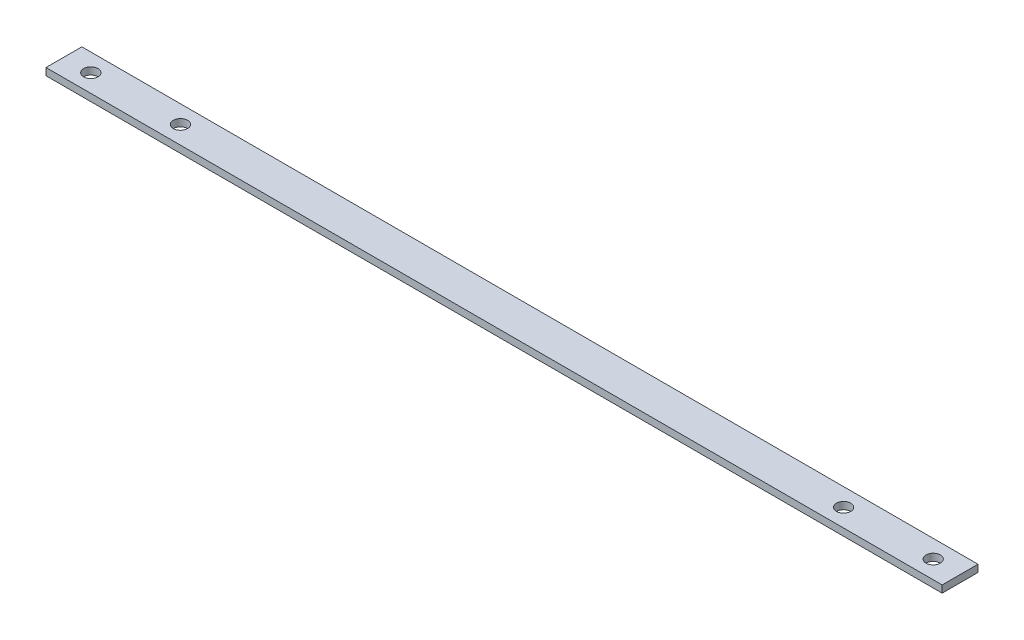
ISO-10303-21;
HEADER;
FILE_DESCRIPTION(('STEP AP214'),'2;1');
FILE_NAME('part.step','',(''),(''),'','','');
FILE_SCHEMA(('AUTOMOTIVE_DESIGN { 1 0 10303 214 1 1 1 1 }'));
ENDSEC;
DATA;
#1=APPLICATION_CONTEXT('core data for automotive mechanical design processes');
#2=APPLICATION_PROTOCOL_DEFINITION('international standard','automotive_design',2000,#1);
#3=PRODUCT_CONTEXT('',#1,'mechanical');
#4=PRODUCT('Part','Part','',(#3));
#5=PRODUCT_RELATED_PRODUCT_CATEGORY('part','',(#4));
#6=PRODUCT_DEFINITION_FORMATION('','',#4);
#7=PRODUCT_DEFINITION_CONTEXT('part definition',#1,'design');
#8=PRODUCT_DEFINITION('design','',#6,#7);
#9=PRODUCT_DEFINITION_SHAPE('','',#8);
#10=(LENGTH_UNIT() NAMED_UNIT(*) SI_UNIT(.MILLI.,.METRE.));
#11=(NAMED_UNIT(*) PLANE_ANGLE_UNIT() SI_UNIT($,.RADIAN.));
#12=(NAMED_UNIT(*) SI_UNIT($,.STERADIAN.) SOLID_ANGLE_UNIT());
#13=UNCERTAINTY_MEASURE_WITH_UNIT(LENGTH_MEASURE(1.E-05),#10,'distance_accuracy_value','');
#14=(GEOMETRIC_REPRESENTATION_CONTEXT(3) GLOBAL_UNCERTAINTY_ASSIGNED_CONTEXT((#13)) GLOBAL_UNIT_ASSIGNED_CONTEXT((#10,
#11,#12)) REPRESENTATION_CONTEXT('',''));
#15=CARTESIAN_POINT('',(0.,0.,0.));
#16=DIRECTION('',(0.,0.,1.));
#17=DIRECTION('',(1.,0.,0.));
#18=AXIS2_PLACEMENT_3D('',#15,#16,#17);
#19=CARTESIAN_POINT('',(500.,-4.,0.));
#20=DIRECTION('',(0.,1.,0.));
#21=DIRECTION('',(0.,0.,1.));
#22=AXIS2_PLACEMENT_3D('',#19,#20,#21);
#23=PLANE('',#22);
#24=CARTESIAN_POINT('',(485.,-4.,-10.));
#25=DIRECTION('',(0.,1.,0.));
#26=DIRECTION('',(0.,0.,1.));
#27=AXIS2_PLACEMENT_3D('',#24,#25,#26);
#28=CIRCLE('',#27,3.99999999999999);
#29=CARTESIAN_POINT('',(485.,-4.,-6.00000000000001));
#30=VERTEX_POINT('',#29);
#31=EDGE_CURVE('E124',#30,#30,#28,.T.);
#32=ORIENTED_EDGE('',*,*,#31,.T.);
#33=EDGE_LOOP('',(#32));
#34=FACE_BOUND('',#33,.T.);
#35=CARTESIAN_POINT('',(435.,-4.,-10.));
#36=DIRECTION('',(0.,1.,0.));
#37=DIRECTION('',(0.,0.,1.));
#38=AXIS2_PLACEMENT_3D('',#35,#36,#37);
#39=CIRCLE('',#38,3.99999999999999);
#40=CARTESIAN_POINT('',(435.,-4.,-6.00000000000001));
#41=VERTEX_POINT('',#40);
#42=EDGE_CURVE('E118',#41,#41,#39,.T.);
#43=ORIENTED_EDGE('',*,*,#42,.T.);
#44=EDGE_LOOP('',(#43));
#45=FACE_BOUND('',#44,.T.);
#46=CARTESIAN_POINT('',(65.,-4.,-10.));
#47=DIRECTION('',(0.,1.,0.));
#48=DIRECTION('',(0.,0.,1.));
#49=AXIS2_PLACEMENT_3D('',#46,#47,#48);
#50=CIRCLE('',#49,4.00000000000001);
#51=CARTESIAN_POINT('',(65.,-4.,-5.99999999999999));
#52=VERTEX_POINT('',#51);
#53=EDGE_CURVE('E112',#52,#52,#50,.T.);
#54=ORIENTED_EDGE('',*,*,#53,.T.);
#55=EDGE_LOOP('',(#54));
#56=FACE_BOUND('',#55,.T.);
#57=CARTESIAN_POINT('',(15.,-4.,-10.));
#58=DIRECTION('',(0.,1.,0.));
#59=DIRECTION('',(0.,0.,1.));
#60=AXIS2_PLACEMENT_3D('',#57,#58,#59);
#61=CIRCLE('',#60,4.);
#62=CARTESIAN_POINT('',(15.,-4.,-6.));
#63=VERTEX_POINT('',#62);
#64=EDGE_CURVE('E99',#63,#63,#61,.T.);
#65=ORIENTED_EDGE('',*,*,#64,.T.);
#66=EDGE_LOOP('',(#65));
#67=FACE_BOUND('',#66,.T.);
#68=DIRECTION('',(0.,0.,-1.));
#69=VECTOR('',#68,1.);
#70=CARTESIAN_POINT('',(0.,-4.,0.));
#71=LINE('',#70,#69);
#72=CARTESIAN_POINT('',(0.,-4.,0.));
#73=VERTEX_POINT('',#72);
#74=CARTESIAN_POINT('',(0.,-4.,-20.));
#75=VERTEX_POINT('',#74);
#76=EDGE_CURVE('E97',#73,#75,#71,.T.);
#77=ORIENTED_EDGE('',*,*,#76,.T.);
#78=DIRECTION('',(-1.,0.,0.));
#79=VECTOR('',#78,1.);
#80=CARTESIAN_POINT('',(500.,-4.,-20.));
#81=LINE('',#80,#79);
#82=CARTESIAN_POINT('',(500.,-4.,-20.));
#83=VERTEX_POINT('',#82);
#84=EDGE_CURVE('E11',#83,#75,#81,.T.);
#85=ORIENTED_EDGE('',*,*,#84,.F.);
#86=DIRECTION('',(0.,0.,-1.));
#87=VECTOR('',#86,1.);
#88=CARTESIAN_POINT('',(500.,-4.,0.));
#89=LINE('',#88,#87);
#90=CARTESIAN_POINT('',(500.,-4.,0.));
#91=VERTEX_POINT('',#90);
#92=EDGE_CURVE('E74',#91,#83,#89,.T.);
#93=ORIENTED_EDGE('',*,*,#92,.F.);
#94=DIRECTION('',(-1.,0.,0.));
#95=VECTOR('',#94,1.);
#96=CARTESIAN_POINT('',(500.,-4.,0.));
#97=LINE('',#96,#95);
#98=EDGE_CURVE('E50',#91,#73,#97,.T.);
#99=ORIENTED_EDGE('',*,*,#98,.T.);
#100=EDGE_LOOP('',(#77,#85,#93,#99));
#101=FACE_BOUND('',#100,.T.);
#102=ADVANCED_FACE('F34',(#34,#45,#56,#67,#101),#23,.F.);
#103=CARTESIAN_POINT('',(500.,0.,-20.));
#104=DIRECTION('',(0.,0.,-1.));
#105=DIRECTION('',(-1.,0.,0.));
#106=AXIS2_PLACEMENT_3D('',#103,#104,#105);
#107=PLANE('',#106);
#108=DIRECTION('',(0.,-1.,0.));
#109=VECTOR('',#108,1.);
#110=CARTESIAN_POINT('',(0.,0.,-20.));
#111=LINE('',#110,#109);
#112=CARTESIAN_POINT('',(0.,0.,-20.));
#113=VERTEX_POINT('',#112);
#114=EDGE_CURVE('E83',#113,#75,#111,.T.);
#115=ORIENTED_EDGE('',*,*,#114,.F.);
#116=DIRECTION('',(-1.,0.,0.));
#117=VECTOR('',#116,1.);
#118=CARTESIAN_POINT('',(500.,0.,-20.));
#119=LINE('',#118,#117);
#120=CARTESIAN_POINT('',(500.,0.,-20.));
#121=VERTEX_POINT('',#120);
#122=EDGE_CURVE('E42',#121,#113,#119,.T.);
#123=ORIENTED_EDGE('',*,*,#122,.F.);
#124=DIRECTION('',(0.,-1.,0.));
#125=VECTOR('',#124,1.);
#126=CARTESIAN_POINT('',(500.,0.,-20.));
#127=LINE('',#126,#125);
#128=EDGE_CURVE('E81',#121,#83,#127,.T.);
#129=ORIENTED_EDGE('',*,*,#128,.T.);
#130=ORIENTED_EDGE('',*,*,#84,.T.);
#131=EDGE_LOOP('',(#115,#123,#129,#130));
#132=FACE_BOUND('',#131,.T.);
#133=ADVANCED_FACE('F80',(#132),#107,.T.);
#134=CARTESIAN_POINT('',(500.,0.,0.));
#135=DIRECTION('',(0.,1.,0.));
#136=DIRECTION('',(0.,0.,1.));
#137=AXIS2_PLACEMENT_3D('',#134,#135,#136);
#138=PLANE('',#137);
#139=CARTESIAN_POINT('',(485.,0.,-10.));
#140=DIRECTION('',(0.,1.,0.));
#141=DIRECTION('',(0.,0.,1.));
#142=AXIS2_PLACEMENT_3D('',#139,#140,#141);
#143=CIRCLE('',#142,3.99999999999999);
#144=CARTESIAN_POINT('',(485.,0.,-6.00000000000001));
#145=VERTEX_POINT('',#144);
#146=EDGE_CURVE('E127',#145,#145,#143,.T.);
#147=ORIENTED_EDGE('',*,*,#146,.F.);
#148=EDGE_LOOP('',(#147));
#149=FACE_BOUND('',#148,.T.);
#150=CARTESIAN_POINT('',(435.,0.,-10.));
#151=DIRECTION('',(0.,1.,0.));
#152=DIRECTION('',(0.,0.,1.));
#153=AXIS2_PLACEMENT_3D('',#150,#151,#152);
#154=CIRCLE('',#153,3.99999999999999);
#155=CARTESIAN_POINT('',(435.,0.,-6.00000000000001));
#156=VERTEX_POINT('',#155);
#157=EDGE_CURVE('E121',#156,#156,#154,.T.);
#158=ORIENTED_EDGE('',*,*,#157,.F.);
#159=EDGE_LOOP('',(#158));
#160=FACE_BOUND('',#159,.T.);
#161=CARTESIAN_POINT('',(65.,0.,-10.));
#162=DIRECTION('',(0.,1.,0.));
#163=DIRECTION('',(0.,0.,1.));
#164=AXIS2_PLACEMENT_3D('',#161,#162,#163);
#165=CIRCLE('',#164,4.00000000000001);
#166=CARTESIAN_POINT('',(65.,0.,-5.99999999999999));
#167=VERTEX_POINT('',#166);
#168=EDGE_CURVE('E115',#167,#167,#165,.T.);
#169=ORIENTED_EDGE('',*,*,#168,.F.);
#170=EDGE_LOOP('',(#169));
#171=FACE_BOUND('',#170,.T.);
#172=CARTESIAN_POINT('',(15.,0.,-10.));
#173=DIRECTION('',(0.,1.,0.));
#174=DIRECTION('',(0.,0.,1.));
#175=AXIS2_PLACEMENT_3D('',#172,#173,#174);
#176=CIRCLE('',#175,4.);
#177=CARTESIAN_POINT('',(15.,0.,-6.));
#178=VERTEX_POINT('',#177);
#179=EDGE_CURVE('E109',#178,#178,#176,.T.);
#180=ORIENTED_EDGE('',*,*,#179,.F.);
#181=EDGE_LOOP('',(#180));
#182=FACE_BOUND('',#181,.T.);
#183=DIRECTION('',(0.,0.,-1.));
#184=VECTOR('',#183,1.);
#185=CARTESIAN_POINT('',(0.,0.,0.));
#186=LINE('',#185,#184);
#187=CARTESIAN_POINT('',(0.,0.,0.));
#188=VERTEX_POINT('',#187);
#189=EDGE_CURVE('E101',#188,#113,#186,.T.);
#190=ORIENTED_EDGE('',*,*,#189,.F.);
#191=DIRECTION('',(-1.,0.,0.));
#192=VECTOR('',#191,1.);
#193=CARTESIAN_POINT('',(500.,0.,0.));
#194=LINE('',#193,#192);
#195=CARTESIAN_POINT('',(500.,0.,0.));
#196=VERTEX_POINT('',#195);
#197=EDGE_CURVE('E63',#196,#188,#194,.T.);
#198=ORIENTED_EDGE('',*,*,#197,.F.);
#199=DIRECTION('',(0.,0.,-1.));
#200=VECTOR('',#199,1.);
#201=CARTESIAN_POINT('',(500.,0.,0.));
#202=LINE('',#201,#200);
#203=EDGE_CURVE('E89',#196,#121,#202,.T.);
#204=ORIENTED_EDGE('',*,*,#203,.T.);
#205=ORIENTED_EDGE('',*,*,#122,.T.);
#206=EDGE_LOOP('',(#190,#198,#204,#205));
#207=FACE_BOUND('',#206,.T.);
#208=ADVANCED_FACE('F91',(#149,#160,#171,#182,#207),#138,.T.);
#209=CARTESIAN_POINT('',(500.,-4.,0.));
#210=DIRECTION('',(0.,0.,1.));
#211=DIRECTION('',(1.,0.,0.));
#212=AXIS2_PLACEMENT_3D('',#209,#210,#211);
#213=PLANE('',#212);
#214=DIRECTION('',(0.,1.,0.));
#215=VECTOR('',#214,1.);
#216=CARTESIAN_POINT('',(0.,-4.,0.));
#217=LINE('',#216,#215);
#218=EDGE_CURVE('E103',#73,#188,#217,.T.);
#219=ORIENTED_EDGE('',*,*,#218,.F.);
#220=ORIENTED_EDGE('',*,*,#98,.F.);
#221=DIRECTION('',(0.,1.,0.));
#222=VECTOR('',#221,1.);
#223=CARTESIAN_POINT('',(500.,-4.,0.));
#224=LINE('',#223,#222);
#225=EDGE_CURVE('E92',#91,#196,#224,.T.);
#226=ORIENTED_EDGE('',*,*,#225,.T.);
#227=ORIENTED_EDGE('',*,*,#197,.T.);
#228=EDGE_LOOP('',(#219,#220,#226,#227));
#229=FACE_BOUND('',#228,.T.);
#230=ADVANCED_FACE('F144',(#229),#213,.T.);
#231=CARTESIAN_POINT('',(500.,0.,0.));
#232=DIRECTION('',(-1.,0.,0.));
#233=DIRECTION('',(0.,0.,1.));
#234=AXIS2_PLACEMENT_3D('',#231,#232,#233);
#235=PLANE('',#234);
#236=ORIENTED_EDGE('',*,*,#92,.T.);
#237=ORIENTED_EDGE('',*,*,#128,.F.);
#238=ORIENTED_EDGE('',*,*,#203,.F.);
#239=ORIENTED_EDGE('',*,*,#225,.F.);
#240=EDGE_LOOP('',(#236,#237,#238,#239));
#241=FACE_BOUND('',#240,.T.);
#242=ADVANCED_FACE('F88',(#241),#235,.F.);
#243=CARTESIAN_POINT('',(0.,0.,0.));
#244=DIRECTION('',(-1.,0.,0.));
#245=DIRECTION('',(0.,0.,1.));
#246=AXIS2_PLACEMENT_3D('',#243,#244,#245);
#247=PLANE('',#246);
#248=ORIENTED_EDGE('',*,*,#76,.F.);
#249=ORIENTED_EDGE('',*,*,#218,.T.);
#250=ORIENTED_EDGE('',*,*,#189,.T.);
#251=ORIENTED_EDGE('',*,*,#114,.T.);
#252=EDGE_LOOP('',(#248,#249,#250,#251));
#253=FACE_BOUND('',#252,.T.);
#254=ADVANCED_FACE('F155',(#253),#247,.T.);
#255=CARTESIAN_POINT('',(15.,-4.,-10.));
#256=DIRECTION('',(0.,1.,0.));
#257=DIRECTION('',(0.,0.,1.));
#258=AXIS2_PLACEMENT_3D('',#255,#256,#257);
#259=CYLINDRICAL_SURFACE('',#258,4.);
#260=ORIENTED_EDGE('',*,*,#64,.F.);
#261=EDGE_LOOP('',(#260));
#262=FACE_BOUND('',#261,.T.);
#263=ORIENTED_EDGE('',*,*,#179,.T.);
#264=EDGE_LOOP('',(#263));
#265=FACE_BOUND('',#264,.T.);
#266=ADVANCED_FACE('F152',(#262,#265),#259,.F.);
#267=CARTESIAN_POINT('',(65.,-4.,-10.));
#268=DIRECTION('',(0.,1.,0.));
#269=DIRECTION('',(0.,0.,1.));
#270=AXIS2_PLACEMENT_3D('',#267,#268,#269);
#271=CYLINDRICAL_SURFACE('',#270,4.00000000000001);
#272=ORIENTED_EDGE('',*,*,#53,.F.);
#273=EDGE_LOOP('',(#272));
#274=FACE_BOUND('',#273,.T.);
#275=ORIENTED_EDGE('',*,*,#168,.T.);
#276=EDGE_LOOP('',(#275));
#277=FACE_BOUND('',#276,.T.);
#278=ADVANCED_FACE('F154',(#274,#277),#271,.F.);
#279=CARTESIAN_POINT('',(435.,-4.,-10.));
#280=DIRECTION('',(0.,1.,0.));
#281=DIRECTION('',(0.,0.,1.));
#282=AXIS2_PLACEMENT_3D('',#279,#280,#281);
#283=CYLINDRICAL_SURFACE('',#282,3.99999999999999);
#284=ORIENTED_EDGE('',*,*,#42,.F.);
#285=EDGE_LOOP('',(#284));
#286=FACE_BOUND('',#285,.T.);
#287=ORIENTED_EDGE('',*,*,#157,.T.);
#288=EDGE_LOOP('',(#287));
#289=FACE_BOUND('',#288,.T.);
#290=ADVANCED_FACE('F138',(#286,#289),#283,.F.);
#291=CARTESIAN_POINT('',(485.,-4.,-10.));
#292=DIRECTION('',(0.,1.,0.));
#293=DIRECTION('',(0.,0.,1.));
#294=AXIS2_PLACEMENT_3D('',#291,#292,#293);
#295=CYLINDRICAL_SURFACE('',#294,3.99999999999999);
#296=ORIENTED_EDGE('',*,*,#31,.F.);
#297=EDGE_LOOP('',(#296));
#298=FACE_BOUND('',#297,.T.);
#299=ORIENTED_EDGE('',*,*,#146,.T.);
#300=EDGE_LOOP('',(#299));
#301=FACE_BOUND('',#300,.T.);
#302=ADVANCED_FACE('F135',(#298,#301),#295,.F.);
#303=CLOSED_SHELL('',(#102,#133,#208,#230,#242,#254,#266,#278,#290,#302));
#304=MANIFOLD_SOLID_BREP('B2',#303);
#305=ADVANCED_BREP_SHAPE_REPRESENTATION('',(#18,#304),#14);
#306=SHAPE_DEFINITION_REPRESENTATION(#9,#305);
ENDSEC;
END-ISO-10303-21;
